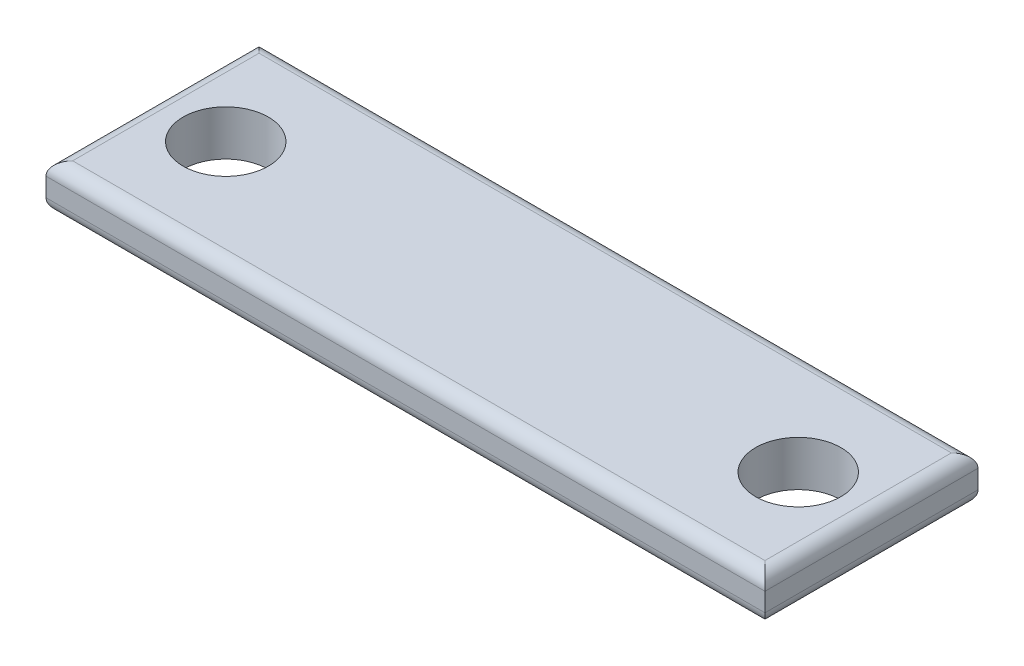
ISO-10303-21;
HEADER;
FILE_DESCRIPTION(('STEP AP214'),'2;1');
FILE_NAME('part.step','',(''),(''),'','','');
FILE_SCHEMA(('AUTOMOTIVE_DESIGN { 1 0 10303 214 1 1 1 1 }'));
ENDSEC;
DATA;
#1=APPLICATION_CONTEXT('core data for automotive mechanical design processes');
#2=APPLICATION_PROTOCOL_DEFINITION('international standard','automotive_design',2000,#1);
#3=PRODUCT_CONTEXT('',#1,'mechanical');
#4=PRODUCT('Part','Part','',(#3));
#5=PRODUCT_RELATED_PRODUCT_CATEGORY('part','',(#4));
#6=PRODUCT_DEFINITION_FORMATION('','',#4);
#7=PRODUCT_DEFINITION_CONTEXT('part definition',#1,'design');
#8=PRODUCT_DEFINITION('design','',#6,#7);
#9=PRODUCT_DEFINITION_SHAPE('','',#8);
#10=(LENGTH_UNIT() NAMED_UNIT(*) SI_UNIT(.MILLI.,.METRE.));
#11=(NAMED_UNIT(*) PLANE_ANGLE_UNIT() SI_UNIT($,.RADIAN.));
#12=(NAMED_UNIT(*) SI_UNIT($,.STERADIAN.) SOLID_ANGLE_UNIT());
#13=UNCERTAINTY_MEASURE_WITH_UNIT(LENGTH_MEASURE(1.E-05),#10,'distance_accuracy_value','');
#14=(GEOMETRIC_REPRESENTATION_CONTEXT(3) GLOBAL_UNCERTAINTY_ASSIGNED_CONTEXT((#13)) GLOBAL_UNIT_ASSIGNED_CONTEXT((#10,
#11,#12)) REPRESENTATION_CONTEXT('',''));
#15=CARTESIAN_POINT('',(0.,0.,0.));
#16=DIRECTION('',(0.,0.,1.));
#17=DIRECTION('',(1.,0.,0.));
#18=AXIS2_PLACEMENT_3D('',#15,#16,#17);
#19=CARTESIAN_POINT('',(0.,1.7,0.));
#20=DIRECTION('',(0.,1.,0.));
#21=DIRECTION('',(0.,0.,1.));
#22=AXIS2_PLACEMENT_3D('',#19,#20,#21);
#23=PLANE('',#22);
#24=DIRECTION('',(1.,0.,0.));
#25=VECTOR('',#24,1.);
#26=CARTESIAN_POINT('',(13.5,1.7,3.5));
#27=LINE('',#26,#25);
#28=CARTESIAN_POINT('',(-13.,1.7,3.5));
#29=VERTEX_POINT('',#28);
#30=CARTESIAN_POINT('',(13.,1.7,3.5));
#31=VERTEX_POINT('',#30);
#32=EDGE_CURVE('E142',#29,#31,#27,.T.);
#33=ORIENTED_EDGE('',*,*,#32,.T.);
#34=DIRECTION('',(0.,0.,-1.));
#35=VECTOR('',#34,1.);
#36=CARTESIAN_POINT('',(13.,1.7,-4.));
#37=LINE('',#36,#35);
#38=CARTESIAN_POINT('',(13.,1.7,-3.5));
#39=VERTEX_POINT('',#38);
#40=EDGE_CURVE('E155',#31,#39,#37,.T.);
#41=ORIENTED_EDGE('',*,*,#40,.T.);
#42=DIRECTION('',(-1.,0.,0.));
#43=VECTOR('',#42,1.);
#44=CARTESIAN_POINT('',(-13.5,1.7,-3.5));
#45=LINE('',#44,#43);
#46=CARTESIAN_POINT('',(-13.,1.7,-3.5));
#47=VERTEX_POINT('',#46);
#48=EDGE_CURVE('E153',#39,#47,#45,.T.);
#49=ORIENTED_EDGE('',*,*,#48,.T.);
#50=DIRECTION('',(0.,0.,1.));
#51=VECTOR('',#50,1.);
#52=CARTESIAN_POINT('',(-13.,1.7,4.));
#53=LINE('',#52,#51);
#54=EDGE_CURVE('E151',#47,#29,#53,.T.);
#55=ORIENTED_EDGE('',*,*,#54,.T.);
#56=EDGE_LOOP('',(#33,#41,#49,#55));
#57=FACE_BOUND('',#56,.T.);
#58=CARTESIAN_POINT('',(-10.75,1.7,0.));
#59=DIRECTION('',(0.,1.,0.));
#60=DIRECTION('',(0.,0.,1.));
#61=AXIS2_PLACEMENT_3D('',#58,#59,#60);
#62=CIRCLE('',#61,1.6);
#63=CARTESIAN_POINT('',(-10.75,1.7,1.6));
#64=VERTEX_POINT('',#63);
#65=EDGE_CURVE('E203',#64,#64,#62,.T.);
#66=ORIENTED_EDGE('',*,*,#65,.F.);
#67=EDGE_LOOP('',(#66));
#68=FACE_BOUND('',#67,.T.);
#69=CARTESIAN_POINT('',(10.75,1.7,0.));
#70=DIRECTION('',(0.,1.,0.));
#71=DIRECTION('',(0.,0.,1.));
#72=AXIS2_PLACEMENT_3D('',#69,#70,#71);
#73=CIRCLE('',#72,1.6);
#74=CARTESIAN_POINT('',(10.75,1.7,1.6));
#75=VERTEX_POINT('',#74);
#76=EDGE_CURVE('E206',#75,#75,#73,.T.);
#77=ORIENTED_EDGE('',*,*,#76,.F.);
#78=EDGE_LOOP('',(#77));
#79=FACE_BOUND('',#78,.T.);
#80=ADVANCED_FACE('F35',(#57,#68,#79),#23,.T.);
#81=CARTESIAN_POINT('',(0.,0.,0.));
#82=DIRECTION('',(0.,1.,0.));
#83=DIRECTION('',(0.,0.,1.));
#84=AXIS2_PLACEMENT_3D('',#81,#82,#83);
#85=PLANE('',#84);
#86=DIRECTION('',(1.,0.,0.));
#87=VECTOR('',#86,1.);
#88=CARTESIAN_POINT('',(0.,0.,3.5));
#89=LINE('',#88,#87);
#90=CARTESIAN_POINT('',(13.,0.,3.5));
#91=VERTEX_POINT('',#90);
#92=CARTESIAN_POINT('',(-13.,0.,3.5));
#93=VERTEX_POINT('',#92);
#94=EDGE_CURVE('E132',#91,#93,#89,.F.);
#95=ORIENTED_EDGE('',*,*,#94,.T.);
#96=DIRECTION('',(0.,0.,1.));
#97=VECTOR('',#96,1.);
#98=CARTESIAN_POINT('',(-13.,0.,0.));
#99=LINE('',#98,#97);
#100=CARTESIAN_POINT('',(-13.,0.,-3.5));
#101=VERTEX_POINT('',#100);
#102=EDGE_CURVE('E115',#93,#101,#99,.F.);
#103=ORIENTED_EDGE('',*,*,#102,.T.);
#104=DIRECTION('',(-1.,0.,0.));
#105=VECTOR('',#104,1.);
#106=CARTESIAN_POINT('',(0.,0.,-3.5));
#107=LINE('',#106,#105);
#108=CARTESIAN_POINT('',(13.,0.,-3.5));
#109=VERTEX_POINT('',#108);
#110=EDGE_CURVE('E137',#101,#109,#107,.F.);
#111=ORIENTED_EDGE('',*,*,#110,.T.);
#112=DIRECTION('',(0.,0.,-1.));
#113=VECTOR('',#112,1.);
#114=CARTESIAN_POINT('',(13.,0.,0.));
#115=LINE('',#114,#113);
#116=EDGE_CURVE('E130',#109,#91,#115,.F.);
#117=ORIENTED_EDGE('',*,*,#116,.T.);
#118=EDGE_LOOP('',(#95,#103,#111,#117));
#119=FACE_BOUND('',#118,.T.);
#120=CARTESIAN_POINT('',(-10.75,0.,0.));
#121=DIRECTION('',(0.,1.,0.));
#122=DIRECTION('',(0.,0.,1.));
#123=AXIS2_PLACEMENT_3D('',#120,#121,#122);
#124=CIRCLE('',#123,1.6);
#125=CARTESIAN_POINT('',(-10.75,0.,1.6));
#126=VERTEX_POINT('',#125);
#127=EDGE_CURVE('E208',#126,#126,#124,.T.);
#128=ORIENTED_EDGE('',*,*,#127,.T.);
#129=EDGE_LOOP('',(#128));
#130=FACE_BOUND('',#129,.T.);
#131=CARTESIAN_POINT('',(10.75,0.,0.));
#132=DIRECTION('',(0.,1.,0.));
#133=DIRECTION('',(0.,0.,1.));
#134=AXIS2_PLACEMENT_3D('',#131,#132,#133);
#135=CIRCLE('',#134,1.6);
#136=CARTESIAN_POINT('',(10.75,0.,1.6));
#137=VERTEX_POINT('',#136);
#138=EDGE_CURVE('E149',#137,#137,#135,.T.);
#139=ORIENTED_EDGE('',*,*,#138,.T.);
#140=EDGE_LOOP('',(#139));
#141=FACE_BOUND('',#140,.T.);
#142=ADVANCED_FACE('F198',(#119,#130,#141),#85,.F.);
#143=CARTESIAN_POINT('',(-13.5,1.7,-4.));
#144=DIRECTION('',(1.,0.,0.));
#145=DIRECTION('',(0.,0.,-1.));
#146=AXIS2_PLACEMENT_3D('',#143,#144,#145);
#147=PLANE('',#146);
#148=DIRECTION('',(0.,-1.,0.));
#149=VECTOR('',#148,1.);
#150=CARTESIAN_POINT('',(-13.5,1.7,4.));
#151=LINE('',#150,#149);
#152=CARTESIAN_POINT('',(-13.5,1.2,4.));
#153=VERTEX_POINT('',#152);
#154=CARTESIAN_POINT('',(-13.5,0.5,4.));
#155=VERTEX_POINT('',#154);
#156=EDGE_CURVE('E98',#153,#155,#151,.T.);
#157=ORIENTED_EDGE('',*,*,#156,.F.);
#158=DIRECTION('',(0.,0.,1.));
#159=VECTOR('',#158,1.);
#160=CARTESIAN_POINT('',(-13.5,1.2,-4.));
#161=LINE('',#160,#159);
#162=CARTESIAN_POINT('',(-13.5,1.2,-4.));
#163=VERTEX_POINT('',#162);
#164=EDGE_CURVE('E44',#153,#163,#161,.F.);
#165=ORIENTED_EDGE('',*,*,#164,.T.);
#166=DIRECTION('',(0.,-1.,0.));
#167=VECTOR('',#166,1.);
#168=CARTESIAN_POINT('',(-13.5,1.7,-4.));
#169=LINE('',#168,#167);
#170=CARTESIAN_POINT('',(-13.5,0.5,-4.));
#171=VERTEX_POINT('',#170);
#172=EDGE_CURVE('E128',#163,#171,#169,.T.);
#173=ORIENTED_EDGE('',*,*,#172,.T.);
#174=DIRECTION('',(0.,0.,1.));
#175=VECTOR('',#174,1.);
#176=CARTESIAN_POINT('',(-13.5,0.5,-4.));
#177=LINE('',#176,#175);
#178=EDGE_CURVE('E105',#171,#155,#177,.T.);
#179=ORIENTED_EDGE('',*,*,#178,.T.);
#180=EDGE_LOOP('',(#157,#165,#173,#179));
#181=FACE_BOUND('',#180,.T.);
#182=ADVANCED_FACE('F127',(#181),#147,.F.);
#183=CARTESIAN_POINT('',(-13.5,1.7,4.));
#184=DIRECTION('',(0.,0.,-1.));
#185=DIRECTION('',(-1.,0.,0.));
#186=AXIS2_PLACEMENT_3D('',#183,#184,#185);
#187=PLANE('',#186);
#188=DIRECTION('',(0.,-1.,0.));
#189=VECTOR('',#188,1.);
#190=CARTESIAN_POINT('',(13.5,1.7,4.));
#191=LINE('',#190,#189);
#192=CARTESIAN_POINT('',(13.5,1.2,4.));
#193=VERTEX_POINT('',#192);
#194=CARTESIAN_POINT('',(13.5,0.5,4.));
#195=VERTEX_POINT('',#194);
#196=EDGE_CURVE('E106',#193,#195,#191,.T.);
#197=ORIENTED_EDGE('',*,*,#196,.F.);
#198=DIRECTION('',(1.,0.,0.));
#199=VECTOR('',#198,1.);
#200=CARTESIAN_POINT('',(-13.5,1.2,4.));
#201=LINE('',#200,#199);
#202=EDGE_CURVE('E11',#193,#153,#201,.F.);
#203=ORIENTED_EDGE('',*,*,#202,.T.);
#204=ORIENTED_EDGE('',*,*,#156,.T.);
#205=DIRECTION('',(1.,0.,0.));
#206=VECTOR('',#205,1.);
#207=CARTESIAN_POINT('',(-13.5,0.5,4.));
#208=LINE('',#207,#206);
#209=EDGE_CURVE('E102',#155,#195,#208,.T.);
#210=ORIENTED_EDGE('',*,*,#209,.T.);
#211=EDGE_LOOP('',(#197,#203,#204,#210));
#212=FACE_BOUND('',#211,.T.);
#213=ADVANCED_FACE('F100',(#212),#187,.F.);
#214=CARTESIAN_POINT('',(13.5,1.7,-4.));
#215=DIRECTION('',(-1.,0.,0.));
#216=DIRECTION('',(0.,0.,1.));
#217=AXIS2_PLACEMENT_3D('',#214,#215,#216);
#218=PLANE('',#217);
#219=DIRECTION('',(0.,-1.,0.));
#220=VECTOR('',#219,1.);
#221=CARTESIAN_POINT('',(13.5,1.7,-4.));
#222=LINE('',#221,#220);
#223=CARTESIAN_POINT('',(13.5,1.2,-4.));
#224=VERTEX_POINT('',#223);
#225=CARTESIAN_POINT('',(13.5,0.5,-4.));
#226=VERTEX_POINT('',#225);
#227=EDGE_CURVE('E186',#224,#226,#222,.T.);
#228=ORIENTED_EDGE('',*,*,#227,.F.);
#229=DIRECTION('',(0.,0.,-1.));
#230=VECTOR('',#229,1.);
#231=CARTESIAN_POINT('',(13.5,1.2,4.));
#232=LINE('',#231,#230);
#233=EDGE_CURVE('E158',#224,#193,#232,.F.);
#234=ORIENTED_EDGE('',*,*,#233,.T.);
#235=ORIENTED_EDGE('',*,*,#196,.T.);
#236=DIRECTION('',(0.,0.,-1.));
#237=VECTOR('',#236,1.);
#238=CARTESIAN_POINT('',(13.5,0.5,-4.));
#239=LINE('',#238,#237);
#240=EDGE_CURVE('E124',#195,#226,#239,.T.);
#241=ORIENTED_EDGE('',*,*,#240,.T.);
#242=EDGE_LOOP('',(#228,#234,#235,#241));
#243=FACE_BOUND('',#242,.T.);
#244=ADVANCED_FACE('F189',(#243),#218,.F.);
#245=CARTESIAN_POINT('',(-13.5,1.7,-4.));
#246=DIRECTION('',(0.,0.,1.));
#247=DIRECTION('',(1.,0.,0.));
#248=AXIS2_PLACEMENT_3D('',#245,#246,#247);
#249=PLANE('',#248);
#250=ORIENTED_EDGE('',*,*,#172,.F.);
#251=DIRECTION('',(-1.,0.,0.));
#252=VECTOR('',#251,1.);
#253=CARTESIAN_POINT('',(13.5,1.2,-4.));
#254=LINE('',#253,#252);
#255=EDGE_CURVE('E161',#163,#224,#254,.F.);
#256=ORIENTED_EDGE('',*,*,#255,.T.);
#257=ORIENTED_EDGE('',*,*,#227,.T.);
#258=DIRECTION('',(-1.,0.,0.));
#259=VECTOR('',#258,1.);
#260=CARTESIAN_POINT('',(-13.5,0.5,-4.));
#261=LINE('',#260,#259);
#262=EDGE_CURVE('E125',#226,#171,#261,.T.);
#263=ORIENTED_EDGE('',*,*,#262,.T.);
#264=EDGE_LOOP('',(#250,#256,#257,#263));
#265=FACE_BOUND('',#264,.T.);
#266=ADVANCED_FACE('F185',(#265),#249,.F.);
#267=CARTESIAN_POINT('',(-10.75,1.7,0.));
#268=DIRECTION('',(0.,-1.,0.));
#269=DIRECTION('',(0.,0.,-1.));
#270=AXIS2_PLACEMENT_3D('',#267,#268,#269);
#271=CYLINDRICAL_SURFACE('',#270,1.6);
#272=ORIENTED_EDGE('',*,*,#65,.T.);
#273=EDGE_LOOP('',(#272));
#274=FACE_BOUND('',#273,.T.);
#275=ORIENTED_EDGE('',*,*,#127,.F.);
#276=EDGE_LOOP('',(#275));
#277=FACE_BOUND('',#276,.T.);
#278=ADVANCED_FACE('F217',(#274,#277),#271,.F.);
#279=CARTESIAN_POINT('',(10.75,1.7,0.));
#280=DIRECTION('',(0.,-1.,0.));
#281=DIRECTION('',(0.,0.,-1.));
#282=AXIS2_PLACEMENT_3D('',#279,#280,#281);
#283=CYLINDRICAL_SURFACE('',#282,1.6);
#284=ORIENTED_EDGE('',*,*,#76,.T.);
#285=EDGE_LOOP('',(#284));
#286=FACE_BOUND('',#285,.T.);
#287=ORIENTED_EDGE('',*,*,#138,.F.);
#288=EDGE_LOOP('',(#287));
#289=FACE_BOUND('',#288,.T.);
#290=ADVANCED_FACE('F220',(#286,#289),#283,.F.);
#291=CARTESIAN_POINT('',(13.,0.5,-4.));
#292=DIRECTION('',(0.,0.,-1.));
#293=DIRECTION('',(-1.,0.,0.));
#294=AXIS2_PLACEMENT_3D('',#291,#292,#293);
#295=CYLINDRICAL_SURFACE('',#294,0.5);
#296=CARTESIAN_POINT('',(13.,0.5,3.5));
#297=DIRECTION('',(0.707106781186547,0.,-0.707106781186547));
#298=DIRECTION('',(-0.707106781186547,0.,-0.707106781186547));
#299=AXIS2_PLACEMENT_3D('',#296,#297,#298);
#300=ELLIPSE('',#299,0.707106781186547,0.5);
#301=EDGE_CURVE('E123',#91,#195,#300,.F.);
#302=ORIENTED_EDGE('',*,*,#301,.F.);
#303=ORIENTED_EDGE('',*,*,#116,.F.);
#304=CARTESIAN_POINT('',(13.,0.5,-3.5));
#305=DIRECTION('',(-0.707106781186547,0.,-0.707106781186547));
#306=DIRECTION('',(0.707106781186548,0.,-0.707106781186547));
#307=AXIS2_PLACEMENT_3D('',#304,#305,#306);
#308=ELLIPSE('',#307,0.707106781186547,0.5);
#309=EDGE_CURVE('E146',#226,#109,#308,.T.);
#310=ORIENTED_EDGE('',*,*,#309,.F.);
#311=ORIENTED_EDGE('',*,*,#240,.F.);
#312=EDGE_LOOP('',(#302,#303,#310,#311));
#313=FACE_BOUND('',#312,.T.);
#314=ADVANCED_FACE('F231',(#313),#295,.T.);
#315=CARTESIAN_POINT('',(-13.5,0.5,-3.5));
#316=DIRECTION('',(-1.,0.,0.));
#317=DIRECTION('',(0.,0.,1.));
#318=AXIS2_PLACEMENT_3D('',#315,#316,#317);
#319=CYLINDRICAL_SURFACE('',#318,0.5);
#320=ORIENTED_EDGE('',*,*,#309,.T.);
#321=ORIENTED_EDGE('',*,*,#110,.F.);
#322=CARTESIAN_POINT('',(-13.,0.5,-3.5));
#323=DIRECTION('',(-0.707106781186548,0.,0.707106781186547));
#324=DIRECTION('',(-0.707106781186547,0.,-0.707106781186547));
#325=AXIS2_PLACEMENT_3D('',#322,#323,#324);
#326=ELLIPSE('',#325,0.707106781186548,0.5);
#327=EDGE_CURVE('E118',#171,#101,#326,.T.);
#328=ORIENTED_EDGE('',*,*,#327,.F.);
#329=ORIENTED_EDGE('',*,*,#262,.F.);
#330=EDGE_LOOP('',(#320,#321,#328,#329));
#331=FACE_BOUND('',#330,.T.);
#332=ADVANCED_FACE('F236',(#331),#319,.T.);
#333=CARTESIAN_POINT('',(-13.5,0.5,3.5));
#334=DIRECTION('',(1.,0.,0.));
#335=DIRECTION('',(0.,0.,-1.));
#336=AXIS2_PLACEMENT_3D('',#333,#334,#335);
#337=CYLINDRICAL_SURFACE('',#336,0.5);
#338=ORIENTED_EDGE('',*,*,#301,.T.);
#339=ORIENTED_EDGE('',*,*,#209,.F.);
#340=CARTESIAN_POINT('',(-13.,0.5,3.5));
#341=DIRECTION('',(0.707106781186547,0.,0.707106781186547));
#342=DIRECTION('',(0.707106781186547,0.,-0.707106781186547));
#343=AXIS2_PLACEMENT_3D('',#340,#341,#342);
#344=ELLIPSE('',#343,0.707106781186547,0.5);
#345=EDGE_CURVE('E112',#93,#155,#344,.F.);
#346=ORIENTED_EDGE('',*,*,#345,.F.);
#347=ORIENTED_EDGE('',*,*,#94,.F.);
#348=EDGE_LOOP('',(#338,#339,#346,#347));
#349=FACE_BOUND('',#348,.T.);
#350=ADVANCED_FACE('F121',(#349),#337,.T.);
#351=CARTESIAN_POINT('',(-13.,0.5,-4.));
#352=DIRECTION('',(0.,0.,1.));
#353=DIRECTION('',(1.,0.,0.));
#354=AXIS2_PLACEMENT_3D('',#351,#352,#353);
#355=CYLINDRICAL_SURFACE('',#354,0.5);
#356=ORIENTED_EDGE('',*,*,#327,.T.);
#357=ORIENTED_EDGE('',*,*,#102,.F.);
#358=ORIENTED_EDGE('',*,*,#345,.T.);
#359=ORIENTED_EDGE('',*,*,#178,.F.);
#360=EDGE_LOOP('',(#356,#357,#358,#359));
#361=FACE_BOUND('',#360,.T.);
#362=ADVANCED_FACE('F113',(#361),#355,.T.);
#363=CARTESIAN_POINT('',(-13.,1.2,0.));
#364=DIRECTION('',(0.,0.,-1.));
#365=DIRECTION('',(-1.,0.,0.));
#366=AXIS2_PLACEMENT_3D('',#363,#364,#365);
#367=CYLINDRICAL_SURFACE('',#366,0.5);
#368=CARTESIAN_POINT('',(-13.,1.2,-3.5));
#369=DIRECTION('',(0.707106781186548,0.,-0.707106781186547));
#370=DIRECTION('',(-0.707106781186547,0.,-0.707106781186547));
#371=AXIS2_PLACEMENT_3D('',#368,#369,#370);
#372=ELLIPSE('',#371,0.707106781186548,0.5);
#373=EDGE_CURVE('E167',#163,#47,#372,.T.);
#374=ORIENTED_EDGE('',*,*,#373,.F.);
#375=ORIENTED_EDGE('',*,*,#164,.F.);
#376=CARTESIAN_POINT('',(-13.,1.2,3.5));
#377=DIRECTION('',(-0.707106781186547,0.,-0.707106781186547));
#378=DIRECTION('',(-0.707106781186547,0.,0.707106781186547));
#379=AXIS2_PLACEMENT_3D('',#376,#377,#378);
#380=ELLIPSE('',#379,0.707106781186547,0.5);
#381=EDGE_CURVE('E39',#29,#153,#380,.F.);
#382=ORIENTED_EDGE('',*,*,#381,.F.);
#383=ORIENTED_EDGE('',*,*,#54,.F.);
#384=EDGE_LOOP('',(#374,#375,#382,#383));
#385=FACE_BOUND('',#384,.T.);
#386=ADVANCED_FACE('F37',(#385),#367,.T.);
#387=CARTESIAN_POINT('',(0.,1.2,3.5));
#388=DIRECTION('',(-1.,0.,0.));
#389=DIRECTION('',(0.,0.,1.));
#390=AXIS2_PLACEMENT_3D('',#387,#388,#389);
#391=CYLINDRICAL_SURFACE('',#390,0.5);
#392=ORIENTED_EDGE('',*,*,#381,.T.);
#393=ORIENTED_EDGE('',*,*,#202,.F.);
#394=CARTESIAN_POINT('',(13.,1.2,3.5));
#395=DIRECTION('',(-0.707106781186547,0.,0.707106781186547));
#396=DIRECTION('',(-0.707106781186547,0.,-0.707106781186547));
#397=AXIS2_PLACEMENT_3D('',#394,#395,#396);
#398=ELLIPSE('',#397,0.707106781186547,0.5);
#399=EDGE_CURVE('E166',#31,#193,#398,.F.);
#400=ORIENTED_EDGE('',*,*,#399,.F.);
#401=ORIENTED_EDGE('',*,*,#32,.F.);
#402=EDGE_LOOP('',(#392,#393,#400,#401));
#403=FACE_BOUND('',#402,.T.);
#404=ADVANCED_FACE('F177',(#403),#391,.T.);
#405=CARTESIAN_POINT('',(0.,1.2,-3.5));
#406=DIRECTION('',(1.,0.,0.));
#407=DIRECTION('',(0.,0.,-1.));
#408=AXIS2_PLACEMENT_3D('',#405,#406,#407);
#409=CYLINDRICAL_SURFACE('',#408,0.5);
#410=ORIENTED_EDGE('',*,*,#373,.T.);
#411=ORIENTED_EDGE('',*,*,#48,.F.);
#412=CARTESIAN_POINT('',(13.,1.2,-3.5));
#413=DIRECTION('',(0.707106781186547,0.,0.707106781186547));
#414=DIRECTION('',(0.707106781186548,0.,-0.707106781186547));
#415=AXIS2_PLACEMENT_3D('',#412,#413,#414);
#416=ELLIPSE('',#415,0.707106781186547,0.5);
#417=EDGE_CURVE('E164',#224,#39,#416,.T.);
#418=ORIENTED_EDGE('',*,*,#417,.F.);
#419=ORIENTED_EDGE('',*,*,#255,.F.);
#420=EDGE_LOOP('',(#410,#411,#418,#419));
#421=FACE_BOUND('',#420,.T.);
#422=ADVANCED_FACE('F182',(#421),#409,.T.);
#423=CARTESIAN_POINT('',(13.,1.2,0.));
#424=DIRECTION('',(0.,0.,1.));
#425=DIRECTION('',(1.,0.,0.));
#426=AXIS2_PLACEMENT_3D('',#423,#424,#425);
#427=CYLINDRICAL_SURFACE('',#426,0.5);
#428=ORIENTED_EDGE('',*,*,#399,.T.);
#429=ORIENTED_EDGE('',*,*,#233,.F.);
#430=ORIENTED_EDGE('',*,*,#417,.T.);
#431=ORIENTED_EDGE('',*,*,#40,.F.);
#432=EDGE_LOOP('',(#428,#429,#430,#431));
#433=FACE_BOUND('',#432,.T.);
#434=ADVANCED_FACE('F193',(#433),#427,.T.);
#435=CLOSED_SHELL('',(#80,#142,#182,#213,#244,#266,#278,#290,#314,#332,#350,#362,#386,#404,#422,#434));
#436=MANIFOLD_SOLID_BREP('B2',#435);
#437=ADVANCED_BREP_SHAPE_REPRESENTATION('',(#18,#436),#14);
#438=SHAPE_DEFINITION_REPRESENTATION(#9,#437);
ENDSEC;
END-ISO-10303-21;
